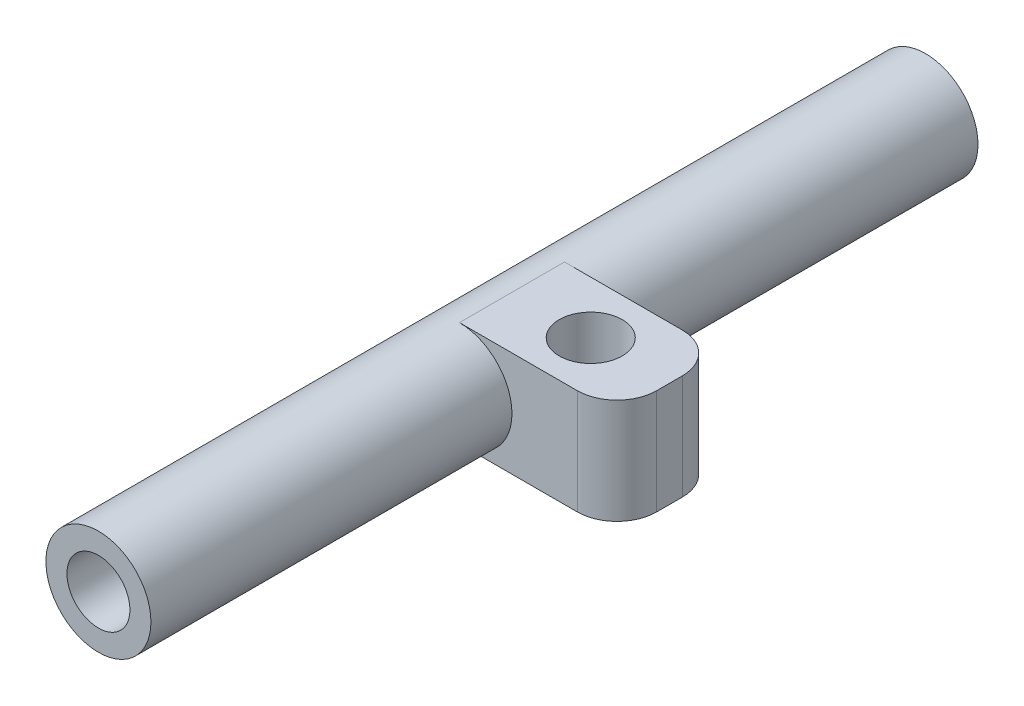
ISO-10303-21;
HEADER;
FILE_DESCRIPTION(('STEP AP214'),'2;1');
FILE_NAME('part.step','',(''),(''),'','','');
FILE_SCHEMA(('AUTOMOTIVE_DESIGN { 1 0 10303 214 1 1 1 1 }'));
ENDSEC;
DATA;
#1=APPLICATION_CONTEXT('core data for automotive mechanical design processes');
#2=APPLICATION_PROTOCOL_DEFINITION('international standard','automotive_design',2000,#1);
#3=PRODUCT_CONTEXT('',#1,'mechanical');
#4=PRODUCT('Part','Part','',(#3));
#5=PRODUCT_RELATED_PRODUCT_CATEGORY('part','',(#4));
#6=PRODUCT_DEFINITION_FORMATION('','',#4);
#7=PRODUCT_DEFINITION_CONTEXT('part definition',#1,'design');
#8=PRODUCT_DEFINITION('design','',#6,#7);
#9=PRODUCT_DEFINITION_SHAPE('','',#8);
#10=(LENGTH_UNIT() NAMED_UNIT(*) SI_UNIT(.MILLI.,.METRE.));
#11=(NAMED_UNIT(*) PLANE_ANGLE_UNIT() SI_UNIT($,.RADIAN.));
#12=(NAMED_UNIT(*) SI_UNIT($,.STERADIAN.) SOLID_ANGLE_UNIT());
#13=UNCERTAINTY_MEASURE_WITH_UNIT(LENGTH_MEASURE(1.E-05),#10,'distance_accuracy_value','');
#14=(GEOMETRIC_REPRESENTATION_CONTEXT(3) GLOBAL_UNCERTAINTY_ASSIGNED_CONTEXT((#13)) GLOBAL_UNIT_ASSIGNED_CONTEXT((#10,
#11,#12)) REPRESENTATION_CONTEXT('',''));
#15=CARTESIAN_POINT('',(0.,0.,0.));
#16=DIRECTION('',(0.,0.,1.));
#17=DIRECTION('',(1.,0.,0.));
#18=AXIS2_PLACEMENT_3D('',#15,#16,#17);
#19=CARTESIAN_POINT('',(0.,0.,125.));
#20=DIRECTION('',(0.,0.,-1.));
#21=DIRECTION('',(-1.,0.,0.));
#22=AXIS2_PLACEMENT_3D('',#19,#20,#21);
#23=CYLINDRICAL_SURFACE('',#22,9.525);
#24=CARTESIAN_POINT('',(0.,0.,125.));
#25=DIRECTION('',(0.,0.,1.));
#26=DIRECTION('',(1.,0.,0.));
#27=AXIS2_PLACEMENT_3D('',#24,#25,#26);
#28=CIRCLE('',#27,9.525);
#29=CARTESIAN_POINT('',(9.525,0.,125.));
#30=VERTEX_POINT('',#29);
#31=EDGE_CURVE('E128',#30,#30,#28,.T.);
#32=ORIENTED_EDGE('',*,*,#31,.T.);
#33=EDGE_LOOP('',(#32));
#34=FACE_BOUND('',#33,.T.);
#35=CARTESIAN_POINT('',(0.,0.,-125.));
#36=DIRECTION('',(0.,0.,1.));
#37=DIRECTION('',(1.,0.,0.));
#38=AXIS2_PLACEMENT_3D('',#35,#36,#37);
#39=CIRCLE('',#38,9.525);
#40=CARTESIAN_POINT('',(9.525,0.,-125.));
#41=VERTEX_POINT('',#40);
#42=EDGE_CURVE('E127',#41,#41,#39,.T.);
#43=ORIENTED_EDGE('',*,*,#42,.F.);
#44=EDGE_LOOP('',(#43));
#45=FACE_BOUND('',#44,.T.);
#46=ADVANCED_FACE('F37',(#34,#45),#23,.F.);
#47=CARTESIAN_POINT('',(0.,0.,125.));
#48=DIRECTION('',(0.,0.,-1.));
#49=DIRECTION('',(-1.,0.,0.));
#50=AXIS2_PLACEMENT_3D('',#47,#48,#49);
#51=CYLINDRICAL_SURFACE('',#50,15.875);
#52=DIRECTION('',(0.,0.,-1.));
#53=VECTOR('',#52,1.);
#54=CARTESIAN_POINT('',(0.,-15.875,15.875));
#55=LINE('',#54,#53);
#56=CARTESIAN_POINT('',(0.,-15.875,15.875));
#57=VERTEX_POINT('',#56);
#58=CARTESIAN_POINT('',(0.,-15.875,-15.875));
#59=VERTEX_POINT('',#58);
#60=EDGE_CURVE('E112',#57,#59,#55,.T.);
#61=ORIENTED_EDGE('',*,*,#60,.F.);
#62=CARTESIAN_POINT('',(0.,0.,15.875));
#63=DIRECTION('',(0.,0.,1.));
#64=DIRECTION('',(1.,0.,0.));
#65=AXIS2_PLACEMENT_3D('',#62,#63,#64);
#66=CIRCLE('',#65,15.875);
#67=CARTESIAN_POINT('',(0.,15.875,15.875));
#68=VERTEX_POINT('',#67);
#69=EDGE_CURVE('E110',#57,#68,#66,.T.);
#70=ORIENTED_EDGE('',*,*,#69,.T.);
#71=DIRECTION('',(0.,0.,-1.));
#72=VECTOR('',#71,1.);
#73=CARTESIAN_POINT('',(0.,15.875,15.875));
#74=LINE('',#73,#72);
#75=CARTESIAN_POINT('',(0.,15.875,-15.875));
#76=VERTEX_POINT('',#75);
#77=EDGE_CURVE('E96',#68,#76,#74,.T.);
#78=ORIENTED_EDGE('',*,*,#77,.T.);
#79=CARTESIAN_POINT('',(0.,0.,-15.875));
#80=DIRECTION('',(0.,0.,1.));
#81=DIRECTION('',(1.,0.,0.));
#82=AXIS2_PLACEMENT_3D('',#79,#80,#81);
#83=CIRCLE('',#82,15.875);
#84=EDGE_CURVE('E99',#59,#76,#83,.T.);
#85=ORIENTED_EDGE('',*,*,#84,.F.);
#86=EDGE_LOOP('',(#61,#70,#78,#85));
#87=FACE_BOUND('',#86,.T.);
#88=CARTESIAN_POINT('',(0.,0.,125.));
#89=DIRECTION('',(0.,0.,1.));
#90=DIRECTION('',(1.,0.,0.));
#91=AXIS2_PLACEMENT_3D('',#88,#89,#90);
#92=CIRCLE('',#91,15.875);
#93=CARTESIAN_POINT('',(15.875,0.,125.));
#94=VERTEX_POINT('',#93);
#95=EDGE_CURVE('E131',#94,#94,#92,.T.);
#96=ORIENTED_EDGE('',*,*,#95,.F.);
#97=EDGE_LOOP('',(#96));
#98=FACE_BOUND('',#97,.T.);
#99=CARTESIAN_POINT('',(0.,0.,-125.));
#100=DIRECTION('',(0.,0.,1.));
#101=DIRECTION('',(1.,0.,0.));
#102=AXIS2_PLACEMENT_3D('',#99,#100,#101);
#103=CIRCLE('',#102,15.875);
#104=CARTESIAN_POINT('',(15.875,0.,-125.));
#105=VERTEX_POINT('',#104);
#106=EDGE_CURVE('E132',#105,#105,#103,.T.);
#107=ORIENTED_EDGE('',*,*,#106,.T.);
#108=EDGE_LOOP('',(#107));
#109=FACE_BOUND('',#108,.T.);
#110=ADVANCED_FACE('F106',(#87,#98,#109),#51,.T.);
#111=CARTESIAN_POINT('',(0.,0.,125.));
#112=DIRECTION('',(0.,0.,1.));
#113=DIRECTION('',(1.,0.,0.));
#114=AXIS2_PLACEMENT_3D('',#111,#112,#113);
#115=PLANE('',#114);
#116=ORIENTED_EDGE('',*,*,#31,.F.);
#117=EDGE_LOOP('',(#116));
#118=FACE_BOUND('',#117,.T.);
#119=ORIENTED_EDGE('',*,*,#95,.T.);
#120=EDGE_LOOP('',(#119));
#121=FACE_BOUND('',#120,.T.);
#122=ADVANCED_FACE('F173',(#118,#121),#115,.T.);
#123=CARTESIAN_POINT('',(0.,0.,-125.));
#124=DIRECTION('',(0.,0.,1.));
#125=DIRECTION('',(1.,0.,0.));
#126=AXIS2_PLACEMENT_3D('',#123,#124,#125);
#127=PLANE('',#126);
#128=ORIENTED_EDGE('',*,*,#42,.T.);
#129=EDGE_LOOP('',(#128));
#130=FACE_BOUND('',#129,.T.);
#131=ORIENTED_EDGE('',*,*,#106,.F.);
#132=EDGE_LOOP('',(#131));
#133=FACE_BOUND('',#132,.T.);
#134=ADVANCED_FACE('F177',(#130,#133),#127,.F.);
#135=CARTESIAN_POINT('',(47.625,0.,15.875));
#136=DIRECTION('',(-1.,0.,0.));
#137=DIRECTION('',(0.,-1.,0.));
#138=AXIS2_PLACEMENT_3D('',#135,#136,#137);
#139=PLANE('',#138);
#140=DIRECTION('',(0.,0.,-1.));
#141=VECTOR('',#140,1.);
#142=CARTESIAN_POINT('',(47.625,-15.875,15.875));
#143=LINE('',#142,#141);
#144=CARTESIAN_POINT('',(47.625,-15.875,3.875));
#145=VERTEX_POINT('',#144);
#146=CARTESIAN_POINT('',(47.625,-15.875,-3.875));
#147=VERTEX_POINT('',#146);
#148=EDGE_CURVE('E121',#145,#147,#143,.T.);
#149=ORIENTED_EDGE('',*,*,#148,.T.);
#150=DIRECTION('',(0.,1.,0.));
#151=VECTOR('',#150,1.);
#152=CARTESIAN_POINT('',(47.625,0.,-3.875));
#153=LINE('',#152,#151);
#154=CARTESIAN_POINT('',(47.625,15.875,-3.875));
#155=VERTEX_POINT('',#154);
#156=EDGE_CURVE('E141',#147,#155,#153,.T.);
#157=ORIENTED_EDGE('',*,*,#156,.T.);
#158=DIRECTION('',(0.,0.,-1.));
#159=VECTOR('',#158,1.);
#160=CARTESIAN_POINT('',(47.625,15.875,15.875));
#161=LINE('',#160,#159);
#162=CARTESIAN_POINT('',(47.625,15.875,3.875));
#163=VERTEX_POINT('',#162);
#164=EDGE_CURVE('E111',#163,#155,#161,.T.);
#165=ORIENTED_EDGE('',*,*,#164,.F.);
#166=DIRECTION('',(0.,1.,0.));
#167=VECTOR('',#166,1.);
#168=CARTESIAN_POINT('',(47.625,-15.875,3.875));
#169=LINE('',#168,#167);
#170=EDGE_CURVE('E135',#163,#145,#169,.F.);
#171=ORIENTED_EDGE('',*,*,#170,.T.);
#172=EDGE_LOOP('',(#149,#157,#165,#171));
#173=FACE_BOUND('',#172,.T.);
#174=ADVANCED_FACE('F153',(#173),#139,.F.);
#175=CARTESIAN_POINT('',(0.,15.875,15.875));
#176=DIRECTION('',(0.,-1.,0.));
#177=DIRECTION('',(1.,0.,0.));
#178=AXIS2_PLACEMENT_3D('',#175,#176,#177);
#179=PLANE('',#178);
#180=CARTESIAN_POINT('',(23.8125,15.875,0.));
#181=DIRECTION('',(0.,1.,0.));
#182=DIRECTION('',(-1.,0.,0.));
#183=AXIS2_PLACEMENT_3D('',#180,#181,#182);
#184=CIRCLE('',#183,9.525);
#185=CARTESIAN_POINT('',(14.2875,15.875,0.));
#186=VERTEX_POINT('',#185);
#187=EDGE_CURVE('E206',#186,#186,#184,.T.);
#188=ORIENTED_EDGE('',*,*,#187,.F.);
#189=EDGE_LOOP('',(#188));
#190=FACE_BOUND('',#189,.T.);
#191=ORIENTED_EDGE('',*,*,#164,.T.);
#192=CARTESIAN_POINT('',(35.625,15.875,-3.875));
#193=DIRECTION('',(0.,-1.,0.));
#194=DIRECTION('',(1.,0.,0.));
#195=AXIS2_PLACEMENT_3D('',#192,#193,#194);
#196=CIRCLE('',#195,12.);
#197=CARTESIAN_POINT('',(35.625,15.875,-15.875));
#198=VERTEX_POINT('',#197);
#199=EDGE_CURVE('E97',#155,#198,#196,.F.);
#200=ORIENTED_EDGE('',*,*,#199,.T.);
#201=DIRECTION('',(-1.,0.,0.));
#202=VECTOR('',#201,1.);
#203=CARTESIAN_POINT('',(0.,15.875,-15.875));
#204=LINE('',#203,#202);
#205=EDGE_CURVE('E91',#198,#76,#204,.T.);
#206=ORIENTED_EDGE('',*,*,#205,.T.);
#207=ORIENTED_EDGE('',*,*,#77,.F.);
#208=DIRECTION('',(-1.,0.,0.));
#209=VECTOR('',#208,1.);
#210=CARTESIAN_POINT('',(0.,15.875,15.875));
#211=LINE('',#210,#209);
#212=CARTESIAN_POINT('',(35.625,15.875,15.875));
#213=VERTEX_POINT('',#212);
#214=EDGE_CURVE('E117',#213,#68,#211,.T.);
#215=ORIENTED_EDGE('',*,*,#214,.F.);
#216=CARTESIAN_POINT('',(35.625,15.875,3.875));
#217=DIRECTION('',(0.,-1.,0.));
#218=DIRECTION('',(1.,0.,0.));
#219=AXIS2_PLACEMENT_3D('',#216,#217,#218);
#220=CIRCLE('',#219,12.);
#221=EDGE_CURVE('E144',#213,#163,#220,.F.);
#222=ORIENTED_EDGE('',*,*,#221,.T.);
#223=EDGE_LOOP('',(#191,#200,#206,#207,#215,#222));
#224=FACE_BOUND('',#223,.T.);
#225=ADVANCED_FACE('F94',(#190,#224),#179,.F.);
#226=CARTESIAN_POINT('',(0.,-15.875,15.875));
#227=DIRECTION('',(0.,-1.,0.));
#228=DIRECTION('',(1.,0.,0.));
#229=AXIS2_PLACEMENT_3D('',#226,#227,#228);
#230=PLANE('',#229);
#231=DIRECTION('',(-1.,0.,0.));
#232=VECTOR('',#231,1.);
#233=CARTESIAN_POINT('',(0.,-15.875,-15.875));
#234=LINE('',#233,#232);
#235=CARTESIAN_POINT('',(35.625,-15.875,-15.875));
#236=VERTEX_POINT('',#235);
#237=EDGE_CURVE('E115',#236,#59,#234,.T.);
#238=ORIENTED_EDGE('',*,*,#237,.F.);
#239=CARTESIAN_POINT('',(35.625,-15.875,-3.875));
#240=DIRECTION('',(0.,-1.,0.));
#241=DIRECTION('',(1.,0.,0.));
#242=AXIS2_PLACEMENT_3D('',#239,#240,#241);
#243=CIRCLE('',#242,12.);
#244=EDGE_CURVE('E45',#236,#147,#243,.T.);
#245=ORIENTED_EDGE('',*,*,#244,.T.);
#246=ORIENTED_EDGE('',*,*,#148,.F.);
#247=CARTESIAN_POINT('',(35.625,-15.875,3.875));
#248=DIRECTION('',(0.,-1.,0.));
#249=DIRECTION('',(1.,0.,0.));
#250=AXIS2_PLACEMENT_3D('',#247,#248,#249);
#251=CIRCLE('',#250,12.);
#252=CARTESIAN_POINT('',(35.625,-15.875,15.875));
#253=VERTEX_POINT('',#252);
#254=EDGE_CURVE('E52',#145,#253,#251,.T.);
#255=ORIENTED_EDGE('',*,*,#254,.T.);
#256=DIRECTION('',(-1.,0.,0.));
#257=VECTOR('',#256,1.);
#258=CARTESIAN_POINT('',(0.,-15.875,15.875));
#259=LINE('',#258,#257);
#260=EDGE_CURVE('E124',#253,#57,#259,.T.);
#261=ORIENTED_EDGE('',*,*,#260,.T.);
#262=ORIENTED_EDGE('',*,*,#60,.T.);
#263=EDGE_LOOP('',(#238,#245,#246,#255,#261,#262));
#264=FACE_BOUND('',#263,.T.);
#265=ADVANCED_FACE('F149',(#264),#230,.T.);
#266=CARTESIAN_POINT('',(0.,0.,15.875));
#267=DIRECTION('',(0.,0.,1.));
#268=DIRECTION('',(1.,0.,0.));
#269=AXIS2_PLACEMENT_3D('',#266,#267,#268);
#270=PLANE('',#269);
#271=ORIENTED_EDGE('',*,*,#260,.F.);
#272=DIRECTION('',(0.,1.,0.));
#273=VECTOR('',#272,1.);
#274=CARTESIAN_POINT('',(35.625,15.875,15.875));
#275=LINE('',#274,#273);
#276=EDGE_CURVE('E11',#253,#213,#275,.T.);
#277=ORIENTED_EDGE('',*,*,#276,.T.);
#278=ORIENTED_EDGE('',*,*,#214,.T.);
#279=ORIENTED_EDGE('',*,*,#69,.F.);
#280=EDGE_LOOP('',(#271,#277,#278,#279));
#281=FACE_BOUND('',#280,.T.);
#282=ADVANCED_FACE('F191',(#281),#270,.T.);
#283=CARTESIAN_POINT('',(0.,0.,-15.875));
#284=DIRECTION('',(0.,0.,1.));
#285=DIRECTION('',(1.,0.,0.));
#286=AXIS2_PLACEMENT_3D('',#283,#284,#285);
#287=PLANE('',#286);
#288=ORIENTED_EDGE('',*,*,#205,.F.);
#289=DIRECTION('',(0.,1.,0.));
#290=VECTOR('',#289,1.);
#291=CARTESIAN_POINT('',(35.625,0.,-15.875));
#292=LINE('',#291,#290);
#293=EDGE_CURVE('E60',#198,#236,#292,.F.);
#294=ORIENTED_EDGE('',*,*,#293,.T.);
#295=ORIENTED_EDGE('',*,*,#237,.T.);
#296=ORIENTED_EDGE('',*,*,#84,.T.);
#297=EDGE_LOOP('',(#288,#294,#295,#296));
#298=FACE_BOUND('',#297,.T.);
#299=ADVANCED_FACE('F114',(#298),#287,.F.);
#300=CARTESIAN_POINT('',(23.8125,-9.525,0.));
#301=DIRECTION('',(0.,1.,0.));
#302=DIRECTION('',(-1.,0.,0.));
#303=AXIS2_PLACEMENT_3D('',#300,#301,#302);
#304=CYLINDRICAL_SURFACE('',#303,9.525);
#305=CARTESIAN_POINT('',(23.8125,-9.525,0.));
#306=DIRECTION('',(0.,1.,0.));
#307=DIRECTION('',(-1.,0.,0.));
#308=AXIS2_PLACEMENT_3D('',#305,#306,#307);
#309=CIRCLE('',#308,9.525);
#310=CARTESIAN_POINT('',(14.2875,-9.525,0.));
#311=VERTEX_POINT('',#310);
#312=EDGE_CURVE('E100',#311,#311,#309,.T.);
#313=ORIENTED_EDGE('',*,*,#312,.F.);
#314=EDGE_LOOP('',(#313));
#315=FACE_BOUND('',#314,.T.);
#316=ORIENTED_EDGE('',*,*,#187,.T.);
#317=EDGE_LOOP('',(#316));
#318=FACE_BOUND('',#317,.T.);
#319=ADVANCED_FACE('F164',(#315,#318),#304,.F.);
#320=CARTESIAN_POINT('',(23.8125,-9.525,0.));
#321=DIRECTION('',(0.,1.,0.));
#322=DIRECTION('',(-1.,0.,0.));
#323=AXIS2_PLACEMENT_3D('',#320,#321,#322);
#324=PLANE('',#323);
#325=ORIENTED_EDGE('',*,*,#312,.T.);
#326=EDGE_LOOP('',(#325));
#327=FACE_BOUND('',#326,.T.);
#328=ADVANCED_FACE('F158',(#327),#324,.T.);
#329=CARTESIAN_POINT('',(35.625,0.,-3.875));
#330=DIRECTION('',(0.,1.,0.));
#331=DIRECTION('',(-1.,0.,0.));
#332=AXIS2_PLACEMENT_3D('',#329,#330,#331);
#333=CYLINDRICAL_SURFACE('',#332,12.);
#334=ORIENTED_EDGE('',*,*,#244,.F.);
#335=ORIENTED_EDGE('',*,*,#293,.F.);
#336=ORIENTED_EDGE('',*,*,#199,.F.);
#337=ORIENTED_EDGE('',*,*,#156,.F.);
#338=EDGE_LOOP('',(#334,#335,#336,#337));
#339=FACE_BOUND('',#338,.T.);
#340=ADVANCED_FACE('F156',(#339),#333,.T.);
#341=CARTESIAN_POINT('',(35.625,0.,3.875));
#342=DIRECTION('',(0.,-1.,0.));
#343=DIRECTION('',(1.,0.,0.));
#344=AXIS2_PLACEMENT_3D('',#341,#342,#343);
#345=CYLINDRICAL_SURFACE('',#344,12.);
#346=ORIENTED_EDGE('',*,*,#254,.F.);
#347=ORIENTED_EDGE('',*,*,#170,.F.);
#348=ORIENTED_EDGE('',*,*,#221,.F.);
#349=ORIENTED_EDGE('',*,*,#276,.F.);
#350=EDGE_LOOP('',(#346,#347,#348,#349));
#351=FACE_BOUND('',#350,.T.);
#352=ADVANCED_FACE('F39',(#351),#345,.T.);
#353=CLOSED_SHELL('',(#46,#110,#122,#134,#174,#225,#265,#282,#299,#319,#328,#340,#352));
#354=MANIFOLD_SOLID_BREP('B2',#353);
#355=ADVANCED_BREP_SHAPE_REPRESENTATION('',(#18,#354),#14);
#356=SHAPE_DEFINITION_REPRESENTATION(#9,#355);
ENDSEC;
END-ISO-10303-21;
